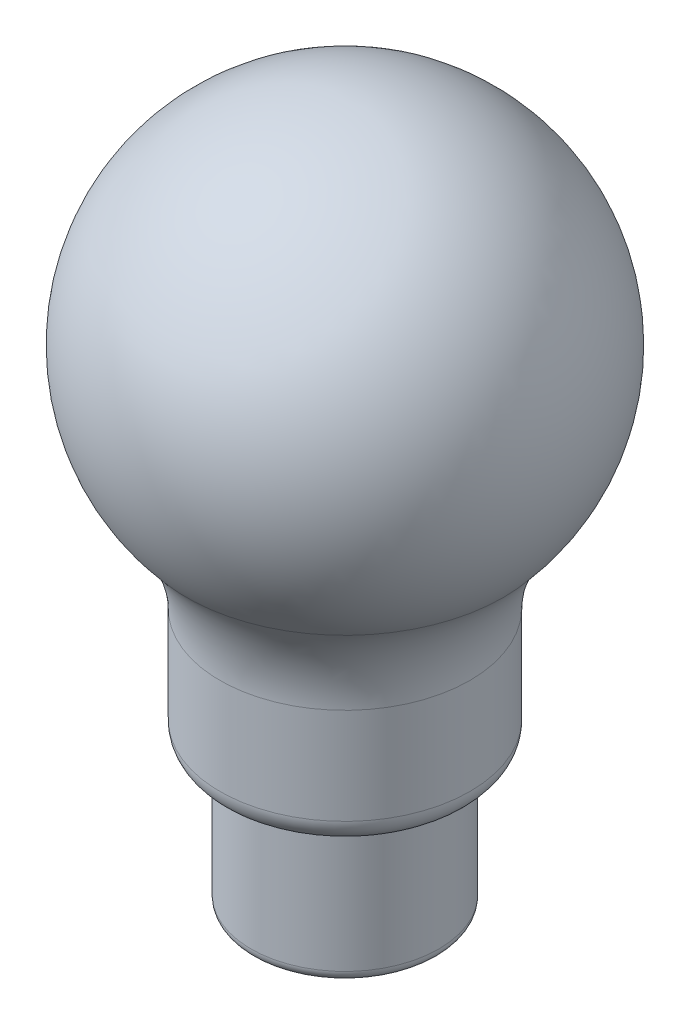
ISO-10303-21;
HEADER;
FILE_DESCRIPTION(('STEP AP214'),'2;1');
FILE_NAME('part.step','',(''),(''),'','','');
FILE_SCHEMA(('AUTOMOTIVE_DESIGN { 1 0 10303 214 1 1 1 1 }'));
ENDSEC;
DATA;
#1=APPLICATION_CONTEXT('core data for automotive mechanical design processes');
#2=APPLICATION_PROTOCOL_DEFINITION('international standard','automotive_design',2000,#1);
#3=PRODUCT_CONTEXT('',#1,'mechanical');
#4=PRODUCT('Part','Part','',(#3));
#5=PRODUCT_RELATED_PRODUCT_CATEGORY('part','',(#4));
#6=PRODUCT_DEFINITION_FORMATION('','',#4);
#7=PRODUCT_DEFINITION_CONTEXT('part definition',#1,'design');
#8=PRODUCT_DEFINITION('design','',#6,#7);
#9=PRODUCT_DEFINITION_SHAPE('','',#8);
#10=(LENGTH_UNIT() NAMED_UNIT(*) SI_UNIT(.MILLI.,.METRE.));
#11=(NAMED_UNIT(*) PLANE_ANGLE_UNIT() SI_UNIT($,.RADIAN.));
#12=(NAMED_UNIT(*) SI_UNIT($,.STERADIAN.) SOLID_ANGLE_UNIT());
#13=UNCERTAINTY_MEASURE_WITH_UNIT(LENGTH_MEASURE(1.E-05),#10,'distance_accuracy_value','');
#14=(GEOMETRIC_REPRESENTATION_CONTEXT(3) GLOBAL_UNCERTAINTY_ASSIGNED_CONTEXT((#13)) GLOBAL_UNIT_ASSIGNED_CONTEXT((#10,
#11,#12)) REPRESENTATION_CONTEXT('',''));
#15=CARTESIAN_POINT('',(0.,0.,0.));
#16=DIRECTION('',(0.,0.,1.));
#17=DIRECTION('',(1.,0.,0.));
#18=AXIS2_PLACEMENT_3D('',#15,#16,#17);
#19=CARTESIAN_POINT('',(0.,60.,0.));
#20=DIRECTION('',(0.,-1.,0.));
#21=DIRECTION('',(1.,0.,0.));
#22=AXIS2_PLACEMENT_3D('',#19,#20,#21);
#23=SPHERICAL_SURFACE('',#22,30.6);
#24=CARTESIAN_POINT('',(0.,39.7600024703559,0.));
#25=DIRECTION('',(0.,-1.,0.));
#26=DIRECTION('',(1.,0.,0.));
#27=AXIS2_PLACEMENT_3D('',#24,#25,#26);
#28=CIRCLE('',#27,22.95);
#29=CARTESIAN_POINT('',(22.95,39.7600024703559,0.));
#30=VERTEX_POINT('',#29);
#31=EDGE_CURVE('E11',#30,#30,#28,.T.);
#32=ORIENTED_EDGE('',*,*,#31,.F.);
#33=EDGE_LOOP('',(#32));
#34=FACE_BOUND('',#33,.T.);
#35=ADVANCED_FACE('F42',(#34),#23,.T.);
#36=CARTESIAN_POINT('',(0.,26.9281086116926,0.));
#37=DIRECTION('',(0.,-1.,0.));
#38=DIRECTION('',(1.,0.,0.));
#39=AXIS2_PLACEMENT_3D('',#36,#37,#38);
#40=TOROIDAL_SURFACE('',#39,37.5,19.4);
#41=CARTESIAN_POINT('',(0.,26.9281086116926,0.));
#42=DIRECTION('',(0.,-1.,0.));
#43=DIRECTION('',(1.,0.,0.));
#44=AXIS2_PLACEMENT_3D('',#41,#42,#43);
#45=CIRCLE('',#44,18.1);
#46=CARTESIAN_POINT('',(18.1,26.9281086116926,0.));
#47=VERTEX_POINT('',#46);
#48=EDGE_CURVE('E48',#47,#47,#45,.T.);
#49=ORIENTED_EDGE('',*,*,#48,.F.);
#50=EDGE_LOOP('',(#49));
#51=FACE_BOUND('',#50,.T.);
#52=ORIENTED_EDGE('',*,*,#31,.T.);
#53=EDGE_LOOP('',(#52));
#54=FACE_BOUND('',#53,.T.);
#55=ADVANCED_FACE('F180',(#51,#54),#40,.F.);
#56=CARTESIAN_POINT('',(0.,-10.6,0.));
#57=DIRECTION('',(0.,-1.,0.));
#58=DIRECTION('',(1.,0.,0.));
#59=AXIS2_PLACEMENT_3D('',#56,#57,#58);
#60=CYLINDRICAL_SURFACE('',#59,18.1);
#61=CARTESIAN_POINT('',(0.,13.,0.));
#62=DIRECTION('',(0.,-1.,0.));
#63=DIRECTION('',(1.,0.,0.));
#64=AXIS2_PLACEMENT_3D('',#61,#62,#63);
#65=CIRCLE('',#64,18.1);
#66=CARTESIAN_POINT('',(18.1,13.,0.));
#67=VERTEX_POINT('',#66);
#68=EDGE_CURVE('E52',#67,#67,#65,.T.);
#69=ORIENTED_EDGE('',*,*,#68,.F.);
#70=EDGE_LOOP('',(#69));
#71=FACE_BOUND('',#70,.T.);
#72=ORIENTED_EDGE('',*,*,#48,.T.);
#73=EDGE_LOOP('',(#72));
#74=FACE_BOUND('',#73,.T.);
#75=ADVANCED_FACE('F175',(#71,#74),#60,.T.);
#76=CARTESIAN_POINT('',(0.,13.,0.));
#77=DIRECTION('',(0.,-1.,0.));
#78=DIRECTION('',(1.,0.,0.));
#79=AXIS2_PLACEMENT_3D('',#76,#77,#78);
#80=TOROIDAL_SURFACE('',#79,14.5,3.6);
#81=CARTESIAN_POINT('',(0.,9.4,0.));
#82=DIRECTION('',(0.,-1.,0.));
#83=DIRECTION('',(1.,0.,0.));
#84=AXIS2_PLACEMENT_3D('',#81,#82,#83);
#85=CIRCLE('',#84,14.5);
#86=CARTESIAN_POINT('',(14.5,9.4,0.));
#87=VERTEX_POINT('',#86);
#88=EDGE_CURVE('E56',#87,#87,#85,.T.);
#89=ORIENTED_EDGE('',*,*,#88,.F.);
#90=EDGE_LOOP('',(#89));
#91=FACE_BOUND('',#90,.T.);
#92=ORIENTED_EDGE('',*,*,#68,.T.);
#93=EDGE_LOOP('',(#92));
#94=FACE_BOUND('',#93,.T.);
#95=ADVANCED_FACE('F169',(#91,#94),#80,.T.);
#96=CARTESIAN_POINT('',(-14.5,9.4,0.));
#97=DIRECTION('',(0.,1.,0.));
#98=DIRECTION('',(-1.,0.,0.));
#99=AXIS2_PLACEMENT_3D('',#96,#97,#98);
#100=PLANE('',#99);
#101=CARTESIAN_POINT('',(0.,9.4,0.));
#102=DIRECTION('',(0.,-1.,0.));
#103=DIRECTION('',(1.,0.,0.));
#104=AXIS2_PLACEMENT_3D('',#101,#102,#103);
#105=CIRCLE('',#104,14.);
#106=CARTESIAN_POINT('',(14.,9.4,0.));
#107=VERTEX_POINT('',#106);
#108=EDGE_CURVE('E61',#107,#107,#105,.T.);
#109=ORIENTED_EDGE('',*,*,#108,.F.);
#110=EDGE_LOOP('',(#109));
#111=FACE_BOUND('',#110,.T.);
#112=ORIENTED_EDGE('',*,*,#88,.T.);
#113=EDGE_LOOP('',(#112));
#114=FACE_BOUND('',#113,.T.);
#115=ADVANCED_FACE('F163',(#111,#114),#100,.F.);
#116=CARTESIAN_POINT('',(0.,8.99999999999999,0.));
#117=DIRECTION('',(0.,-1.,0.));
#118=DIRECTION('',(1.,0.,0.));
#119=AXIS2_PLACEMENT_3D('',#116,#117,#118);
#120=TOROIDAL_SURFACE('',#119,14.,0.400000000000001);
#121=CARTESIAN_POINT('',(0.,8.99999999999999,0.));
#122=DIRECTION('',(0.,-1.,0.));
#123=DIRECTION('',(1.,0.,0.));
#124=AXIS2_PLACEMENT_3D('',#121,#122,#123);
#125=CIRCLE('',#124,13.6);
#126=CARTESIAN_POINT('',(13.6,8.99999999999999,0.));
#127=VERTEX_POINT('',#126);
#128=EDGE_CURVE('E64',#127,#127,#125,.T.);
#129=ORIENTED_EDGE('',*,*,#128,.F.);
#130=EDGE_LOOP('',(#129));
#131=FACE_BOUND('',#130,.T.);
#132=ORIENTED_EDGE('',*,*,#108,.T.);
#133=EDGE_LOOP('',(#132));
#134=FACE_BOUND('',#133,.T.);
#135=ADVANCED_FACE('F157',(#131,#134),#120,.F.);
#136=CARTESIAN_POINT('',(0.,-10.6,0.));
#137=DIRECTION('',(0.,-1.,0.));
#138=DIRECTION('',(1.,0.,0.));
#139=AXIS2_PLACEMENT_3D('',#136,#137,#138);
#140=CYLINDRICAL_SURFACE('',#139,13.6);
#141=CARTESIAN_POINT('',(0.,-9.00000000000001,0.));
#142=DIRECTION('',(0.,-1.,0.));
#143=DIRECTION('',(1.,0.,0.));
#144=AXIS2_PLACEMENT_3D('',#141,#142,#143);
#145=CIRCLE('',#144,13.6);
#146=CARTESIAN_POINT('',(13.6,-9.00000000000001,0.));
#147=VERTEX_POINT('',#146);
#148=EDGE_CURVE('E67',#147,#147,#145,.T.);
#149=ORIENTED_EDGE('',*,*,#148,.F.);
#150=EDGE_LOOP('',(#149));
#151=FACE_BOUND('',#150,.T.);
#152=ORIENTED_EDGE('',*,*,#128,.T.);
#153=EDGE_LOOP('',(#152));
#154=FACE_BOUND('',#153,.T.);
#155=ADVANCED_FACE('F151',(#151,#154),#140,.T.);
#156=CARTESIAN_POINT('',(0.,-9.00000000000001,0.));
#157=DIRECTION('',(0.,-1.,0.));
#158=DIRECTION('',(1.,0.,0.));
#159=AXIS2_PLACEMENT_3D('',#156,#157,#158);
#160=TOROIDAL_SURFACE('',#159,12.,1.6);
#161=CARTESIAN_POINT('',(0.,-10.6,0.));
#162=DIRECTION('',(0.,-1.,0.));
#163=DIRECTION('',(1.,0.,0.));
#164=AXIS2_PLACEMENT_3D('',#161,#162,#163);
#165=CIRCLE('',#164,12.);
#166=CARTESIAN_POINT('',(12.,-10.6,0.));
#167=VERTEX_POINT('',#166);
#168=EDGE_CURVE('E70',#167,#167,#165,.T.);
#169=ORIENTED_EDGE('',*,*,#168,.F.);
#170=EDGE_LOOP('',(#169));
#171=FACE_BOUND('',#170,.T.);
#172=ORIENTED_EDGE('',*,*,#148,.T.);
#173=EDGE_LOOP('',(#172));
#174=FACE_BOUND('',#173,.T.);
#175=ADVANCED_FACE('F145',(#171,#174),#160,.T.);
#176=CARTESIAN_POINT('',(0.,-10.6,0.));
#177=DIRECTION('',(0.,-1.,0.));
#178=DIRECTION('',(1.,0.,0.));
#179=AXIS2_PLACEMENT_3D('',#176,#177,#178);
#180=CYLINDRICAL_SURFACE('',#179,12.);
#181=CARTESIAN_POINT('',(0.,-10.,0.));
#182=DIRECTION('',(0.,-1.,0.));
#183=DIRECTION('',(1.,0.,0.));
#184=AXIS2_PLACEMENT_3D('',#181,#182,#183);
#185=CIRCLE('',#184,12.);
#186=CARTESIAN_POINT('',(12.,-10.,0.));
#187=VERTEX_POINT('',#186);
#188=EDGE_CURVE('E73',#187,#187,#185,.T.);
#189=ORIENTED_EDGE('',*,*,#188,.F.);
#190=EDGE_LOOP('',(#189));
#191=FACE_BOUND('',#190,.T.);
#192=ORIENTED_EDGE('',*,*,#168,.T.);
#193=EDGE_LOOP('',(#192));
#194=FACE_BOUND('',#193,.T.);
#195=ADVANCED_FACE('F139',(#191,#194),#180,.F.);
#196=CARTESIAN_POINT('',(0.,-9.00000000000001,0.));
#197=DIRECTION('',(0.,-1.,0.));
#198=DIRECTION('',(1.,0.,0.));
#199=AXIS2_PLACEMENT_3D('',#196,#197,#198);
#200=TOROIDAL_SURFACE('',#199,12.,1.);
#201=CARTESIAN_POINT('',(0.,-9.,0.));
#202=DIRECTION('',(0.,-1.,0.));
#203=DIRECTION('',(1.,0.,0.));
#204=AXIS2_PLACEMENT_3D('',#201,#202,#203);
#205=CIRCLE('',#204,13.);
#206=CARTESIAN_POINT('',(13.,-9.,0.));
#207=VERTEX_POINT('',#206);
#208=EDGE_CURVE('E76',#207,#207,#205,.T.);
#209=ORIENTED_EDGE('',*,*,#208,.F.);
#210=EDGE_LOOP('',(#209));
#211=FACE_BOUND('',#210,.T.);
#212=ORIENTED_EDGE('',*,*,#188,.T.);
#213=EDGE_LOOP('',(#212));
#214=FACE_BOUND('',#213,.T.);
#215=ADVANCED_FACE('F133',(#211,#214),#200,.F.);
#216=CARTESIAN_POINT('',(0.,-10.6,0.));
#217=DIRECTION('',(0.,-1.,0.));
#218=DIRECTION('',(1.,0.,0.));
#219=AXIS2_PLACEMENT_3D('',#216,#217,#218);
#220=CYLINDRICAL_SURFACE('',#219,13.);
#221=CARTESIAN_POINT('',(0.,8.99999999999999,0.));
#222=DIRECTION('',(0.,-1.,0.));
#223=DIRECTION('',(1.,0.,0.));
#224=AXIS2_PLACEMENT_3D('',#221,#222,#223);
#225=CIRCLE('',#224,13.);
#226=CARTESIAN_POINT('',(13.,8.99999999999999,0.));
#227=VERTEX_POINT('',#226);
#228=EDGE_CURVE('E79',#227,#227,#225,.T.);
#229=ORIENTED_EDGE('',*,*,#228,.F.);
#230=EDGE_LOOP('',(#229));
#231=FACE_BOUND('',#230,.T.);
#232=ORIENTED_EDGE('',*,*,#208,.T.);
#233=EDGE_LOOP('',(#232));
#234=FACE_BOUND('',#233,.T.);
#235=ADVANCED_FACE('F127',(#231,#234),#220,.F.);
#236=CARTESIAN_POINT('',(0.,8.99999999999999,0.));
#237=DIRECTION('',(0.,-1.,0.));
#238=DIRECTION('',(1.,0.,0.));
#239=AXIS2_PLACEMENT_3D('',#236,#237,#238);
#240=TOROIDAL_SURFACE('',#239,14.,1.);
#241=CARTESIAN_POINT('',(0.,9.99999999999999,0.));
#242=DIRECTION('',(0.,-1.,0.));
#243=DIRECTION('',(1.,0.,0.));
#244=AXIS2_PLACEMENT_3D('',#241,#242,#243);
#245=CIRCLE('',#244,14.);
#246=CARTESIAN_POINT('',(14.,9.99999999999999,0.));
#247=VERTEX_POINT('',#246);
#248=EDGE_CURVE('E82',#247,#247,#245,.T.);
#249=ORIENTED_EDGE('',*,*,#248,.F.);
#250=EDGE_LOOP('',(#249));
#251=FACE_BOUND('',#250,.T.);
#252=ORIENTED_EDGE('',*,*,#228,.T.);
#253=EDGE_LOOP('',(#252));
#254=FACE_BOUND('',#253,.T.);
#255=ADVANCED_FACE('F121',(#251,#254),#240,.T.);
#256=CARTESIAN_POINT('',(-14.5,9.99999999999999,0.));
#257=DIRECTION('',(0.,-1.,0.));
#258=DIRECTION('',(1.,0.,0.));
#259=AXIS2_PLACEMENT_3D('',#256,#257,#258);
#260=PLANE('',#259);
#261=CARTESIAN_POINT('',(0.,9.99999999999999,0.));
#262=DIRECTION('',(0.,-1.,0.));
#263=DIRECTION('',(1.,0.,0.));
#264=AXIS2_PLACEMENT_3D('',#261,#262,#263);
#265=CIRCLE('',#264,14.5);
#266=CARTESIAN_POINT('',(14.5,9.99999999999999,0.));
#267=VERTEX_POINT('',#266);
#268=EDGE_CURVE('E85',#267,#267,#265,.T.);
#269=ORIENTED_EDGE('',*,*,#268,.F.);
#270=EDGE_LOOP('',(#269));
#271=FACE_BOUND('',#270,.T.);
#272=ORIENTED_EDGE('',*,*,#248,.T.);
#273=EDGE_LOOP('',(#272));
#274=FACE_BOUND('',#273,.T.);
#275=ADVANCED_FACE('F115',(#271,#274),#260,.F.);
#276=CARTESIAN_POINT('',(0.,13.,0.));
#277=DIRECTION('',(0.,-1.,0.));
#278=DIRECTION('',(1.,0.,0.));
#279=AXIS2_PLACEMENT_3D('',#276,#277,#278);
#280=TOROIDAL_SURFACE('',#279,14.5,3.);
#281=CARTESIAN_POINT('',(0.,13.,0.));
#282=DIRECTION('',(0.,-1.,0.));
#283=DIRECTION('',(1.,0.,0.));
#284=AXIS2_PLACEMENT_3D('',#281,#282,#283);
#285=CIRCLE('',#284,17.5);
#286=CARTESIAN_POINT('',(17.5,13.,0.));
#287=VERTEX_POINT('',#286);
#288=EDGE_CURVE('E88',#287,#287,#285,.T.);
#289=ORIENTED_EDGE('',*,*,#288,.F.);
#290=EDGE_LOOP('',(#289));
#291=FACE_BOUND('',#290,.T.);
#292=ORIENTED_EDGE('',*,*,#268,.T.);
#293=EDGE_LOOP('',(#292));
#294=FACE_BOUND('',#293,.T.);
#295=ADVANCED_FACE('F109',(#291,#294),#280,.F.);
#296=CARTESIAN_POINT('',(0.,-10.6,0.));
#297=DIRECTION('',(0.,-1.,0.));
#298=DIRECTION('',(1.,0.,0.));
#299=AXIS2_PLACEMENT_3D('',#296,#297,#298);
#300=CYLINDRICAL_SURFACE('',#299,17.5);
#301=CARTESIAN_POINT('',(0.,26.9281086116926,0.));
#302=DIRECTION('',(0.,-1.,0.));
#303=DIRECTION('',(1.,0.,0.));
#304=AXIS2_PLACEMENT_3D('',#301,#302,#303);
#305=CIRCLE('',#304,17.5);
#306=CARTESIAN_POINT('',(17.5,26.9281086116926,0.));
#307=VERTEX_POINT('',#306);
#308=EDGE_CURVE('E91',#307,#307,#305,.T.);
#309=ORIENTED_EDGE('',*,*,#308,.F.);
#310=EDGE_LOOP('',(#309));
#311=FACE_BOUND('',#310,.T.);
#312=ORIENTED_EDGE('',*,*,#288,.T.);
#313=EDGE_LOOP('',(#312));
#314=FACE_BOUND('',#313,.T.);
#315=ADVANCED_FACE('F103',(#311,#314),#300,.F.);
#316=CARTESIAN_POINT('',(0.,26.9281086116926,0.));
#317=DIRECTION('',(0.,-1.,0.));
#318=DIRECTION('',(1.,0.,0.));
#319=AXIS2_PLACEMENT_3D('',#316,#317,#318);
#320=TOROIDAL_SURFACE('',#319,37.5,20.);
#321=CARTESIAN_POINT('',(0.,40.1568651670156,0.));
#322=DIRECTION('',(0.,-1.,0.));
#323=DIRECTION('',(1.,0.,0.));
#324=AXIS2_PLACEMENT_3D('',#321,#322,#323);
#325=CIRCLE('',#324,22.5);
#326=CARTESIAN_POINT('',(22.5,40.1568651670156,0.));
#327=VERTEX_POINT('',#326);
#328=EDGE_CURVE('E94',#327,#327,#325,.T.);
#329=ORIENTED_EDGE('',*,*,#328,.F.);
#330=EDGE_LOOP('',(#329));
#331=FACE_BOUND('',#330,.T.);
#332=ORIENTED_EDGE('',*,*,#308,.T.);
#333=EDGE_LOOP('',(#332));
#334=FACE_BOUND('',#333,.T.);
#335=ADVANCED_FACE('F100',(#331,#334),#320,.T.);
#336=CARTESIAN_POINT('',(0.,60.,0.));
#337=DIRECTION('',(0.,-1.,0.));
#338=DIRECTION('',(-1.,0.,0.));
#339=AXIS2_PLACEMENT_3D('',#336,#337,#338);
#340=SPHERICAL_SURFACE('',#339,30.);
#341=ORIENTED_EDGE('',*,*,#328,.T.);
#342=EDGE_LOOP('',(#341));
#343=FACE_BOUND('',#342,.T.);
#344=ADVANCED_FACE('F98',(#343),#340,.F.);
#345=CLOSED_SHELL('',(#35,#55,#75,#95,#115,#135,#155,#175,#195,#215,#235,#255,#275,#295,#315,
#335,#344));
#346=MANIFOLD_SOLID_BREP('B2',#345);
#347=CARTESIAN_POINT('',(-7.5,0.,0.));
#348=DIRECTION('',(0.,1.,0.));
#349=DIRECTION('',(0.,0.,1.));
#350=AXIS2_PLACEMENT_3D('',#347,#348,#349);
#351=PLANE('',#350);
#352=CARTESIAN_POINT('',(-7.5,0.,0.));
#353=DIRECTION('',(0.,1.,0.));
#354=DIRECTION('',(0.,0.,1.));
#355=AXIS2_PLACEMENT_3D('',#352,#353,#354);
#356=CIRCLE('',#355,0.500000000000001);
#357=CARTESIAN_POINT('',(-7.5,0.,0.500000000000001));
#358=VERTEX_POINT('',#357);
#359=EDGE_CURVE('E313',#358,#358,#356,.T.);
#360=ORIENTED_EDGE('',*,*,#359,.F.);
#361=EDGE_LOOP('',(#360));
#362=FACE_BOUND('',#361,.T.);
#363=ADVANCED_FACE('F301',(#362),#351,.F.);
#364=CARTESIAN_POINT('',(-8.,50.,0.));
#365=DIRECTION('',(-0.033321671547809,0.999444678911874,0.));
#366=DIRECTION('',(0.,0.,1.));
#367=AXIS2_PLACEMENT_3D('',#364,#365,#366);
#368=PLANE('',#367);
#369=CARTESIAN_POINT('',(-8.,50.,0.));
#370=DIRECTION('',(-0.033321671547809,0.999444678911874,0.));
#371=DIRECTION('',(0.,0.,1.));
#372=AXIS2_PLACEMENT_3D('',#369,#370,#371);
#373=CIRCLE('',#372,0.500000000000001);
#374=CARTESIAN_POINT('',(-8.,50.,0.500000000000001));
#375=VERTEX_POINT('',#374);
#376=EDGE_CURVE('E40',#375,#375,#373,.T.);
#377=ORIENTED_EDGE('',*,*,#376,.T.);
#378=EDGE_LOOP('',(#377));
#379=FACE_BOUND('',#378,.T.);
#380=ADVANCED_FACE('F321',(#379),#368,.T.);
#381=CARTESIAN_POINT('',(-7.5,0.,0.500000000000001));
#382=CARTESIAN_POINT('',(-7.38890431773929,16.6689811921876,0.500000000000001));
#383=CARTESIAN_POINT('',(-7.55557098441971,33.3356478588716,0.500000000000001));
#384=CARTESIAN_POINT('',(-8.,50.,0.500000000000001));
#385=CARTESIAN_POINT('',(-6.5,0.,0.500000000000001));
#386=CARTESIAN_POINT('',(-6.38890431773567,16.6800890330693,0.500000000000001));
#387=CARTESIAN_POINT('',(-6.55575621482854,33.3578690913781,0.500000000000001));
#388=CARTESIAN_POINT('',(-7.00055532108813,50.0333216715478,0.500000000000001));
#389=CARTESIAN_POINT('',(-6.5,0.,-0.500000000000001));
#390=CARTESIAN_POINT('',(-6.38890431773567,16.6800890330693,-0.500000000000001));
#391=CARTESIAN_POINT('',(-6.55575621482854,33.3578690913781,-0.500000000000001));
#392=CARTESIAN_POINT('',(-7.00055532108813,50.0333216715478,-0.500000000000001));
#393=CARTESIAN_POINT('',(-7.5,0.,-0.500000000000001));
#394=CARTESIAN_POINT('',(-7.38890431773929,16.6689811921876,-0.500000000000001));
#395=CARTESIAN_POINT('',(-7.55557098441971,33.3356478588716,-0.500000000000001));
#396=CARTESIAN_POINT('',(-8.,50.,-0.500000000000001));
#397=CARTESIAN_POINT('',(-8.5,0.,-0.500000000000001));
#398=CARTESIAN_POINT('',(-8.3889043177429,16.6578733513058,-0.500000000000001));
#399=CARTESIAN_POINT('',(-8.55538575401087,33.3134266263651,-0.500000000000001));
#400=CARTESIAN_POINT('',(-8.99944467891188,49.9666783284522,-0.500000000000001));
#401=CARTESIAN_POINT('',(-8.5,0.,0.500000000000001));
#402=CARTESIAN_POINT('',(-8.3889043177429,16.6578733513058,0.500000000000001));
#403=CARTESIAN_POINT('',(-8.55538575401087,33.3134266263651,0.500000000000001));
#404=CARTESIAN_POINT('',(-8.99944467891188,49.9666783284522,0.500000000000001));
#405=CARTESIAN_POINT('',(-7.5,0.,0.500000000000001));
#406=CARTESIAN_POINT('',(-7.38890431773929,16.6689811921876,0.500000000000001));
#407=CARTESIAN_POINT('',(-7.55557098441971,33.3356478588716,0.500000000000001));
#408=CARTESIAN_POINT('',(-8.,50.,0.500000000000001));
#409=(BOUNDED_SURFACE() B_SPLINE_SURFACE(3,3,((#381,#382,#383,#384),(#385,#386,#387,#388),(#389,
#390,#391,#392),(#393,#394,#395,#396),(#397,#398,#399,#400),(#401,#402,#403,#404),(#405,#406,
#407,#408)),.UNSPECIFIED.,.T.,.F.,.F.) B_SPLINE_SURFACE_WITH_KNOTS((4,3,4),(4,4),(0.,0.5,1.),
(0.,1.),.UNSPECIFIED.) GEOMETRIC_REPRESENTATION_ITEM() RATIONAL_B_SPLINE_SURFACE(((1.,1.,1.,1.),
(0.333333333333333,0.333333333333333,0.333333333333333,0.333333333333333),(0.333333333333333,
0.333333333333333,0.333333333333333,0.333333333333333),(1.,1.,1.,1.),(0.333333333333333,
0.333333333333333,0.333333333333333,0.333333333333333),(0.333333333333333,0.333333333333333,
0.333333333333333,0.333333333333333),(1.,1.,1.,1.))) REPRESENTATION_ITEM('') SURFACE());
#410=CARTESIAN_POINT('',(-7.51483681204918,49.,-0.19902371186404));
#411=CARTESIAN_POINT('',(-7.51517709232452,49.0132447334164,-0.199017755515471));
#412=CARTESIAN_POINT('',(-7.51457763798246,49.0265328271919,-0.196878854861582));
#413=CARTESIAN_POINT('',(-7.5117970515096,49.0515680290947,-0.188655941320381));
#414=CARTESIAN_POINT('',(-7.50961836237461,49.0633174843108,-0.182578023428362));
#415=CARTESIAN_POINT('',(-7.50433544868718,49.0847030924109,-0.166939550761019));
#416=CARTESIAN_POINT('',(-7.50119657002605,49.094231321699,-0.157244947701196));
#417=CARTESIAN_POINT('',(-7.49470366052559,49.110233679619,-0.134659147005632));
#418=CARTESIAN_POINT('',(-7.49134841479063,49.11648040691,-0.121606359225872));
#419=CARTESIAN_POINT('',(-7.48543573507246,49.1242466149204,-0.0938984437468798));
#420=CARTESIAN_POINT('',(-7.48288235093723,49.1257424362879,-0.0792356715633702));
#421=CARTESIAN_POINT('',(-7.47909638388248,49.1235982112357,-0.0506583042013944));
#422=CARTESIAN_POINT('',(-7.47781868997836,49.1201449766677,-0.0367360223425042));
#423=CARTESIAN_POINT('',(-7.47630297900317,49.1089053022549,-0.011131158339641));
#424=CARTESIAN_POINT('',(-7.47603972911151,49.1012295330343,0.000598777270067193));
#425=CARTESIAN_POINT('',(-7.47598496986063,49.0824342369158,0.0209640152088744));
#426=CARTESIAN_POINT('',(-7.47619573313149,49.0712983411253,0.0295841780934244));
#427=CARTESIAN_POINT('',(-7.47650818643177,49.0466801955521,0.0427795714563394));
#428=CARTESIAN_POINT('',(-7.47660865686307,49.0331735888759,0.0473094772741834));
#429=CARTESIAN_POINT('',(-7.47631709983292,49.0054409231619,0.0516429366297732));
#430=CARTESIAN_POINT('',(-7.47592559751163,48.991215646791,0.0514515257219447));
#431=CARTESIAN_POINT('',(-7.47471488979079,48.9636766113153,0.0463979632199125));
#432=CARTESIAN_POINT('',(-7.47389658655974,48.9503609962637,0.0415456456752786));
#433=CARTESIAN_POINT('',(-7.47230453823803,48.925990496523,0.0276879785302688));
#434=CARTESIAN_POINT('',(-7.47153108434455,48.914949405588,0.0186583086230816));
#435=CARTESIAN_POINT('',(-7.47071561670913,48.8964928469214,-0.00255342706084687));
#436=CARTESIAN_POINT('',(-7.4706716594419,48.8890677966417,-0.0147270287576783));
#437=CARTESIAN_POINT('',(-7.47184402601425,48.8787870000576,-0.0405373687042223));
#438=CARTESIAN_POINT('',(-7.47303510458604,48.8758426434352,-0.0541398860812502));
#439=CARTESIAN_POINT('',(-7.47670767196463,48.8744781092943,-0.0812473403029313));
#440=CARTESIAN_POINT('',(-7.47917696047299,48.8760157831259,-0.0947519966690528));
#441=CARTESIAN_POINT('',(-7.4850980732061,48.8832641154714,-0.120778868319435));
#442=CARTESIAN_POINT('',(-7.48857684501629,48.8890970838516,-0.133260111387992));
#443=CARTESIAN_POINT('',(-7.49592457328012,48.9047783965278,-0.15625546637269));
#444=CARTESIAN_POINT('',(-7.49980439071636,48.9148173338421,-0.166635860658294));
#445=CARTESIAN_POINT('',(-7.50676711555614,48.9382104699953,-0.183646972471138));
#446=CARTESIAN_POINT('',(-7.50983771124693,48.9516104324357,-0.190221400985941));
#447=CARTESIAN_POINT('',(-7.51352495050318,48.9768903007421,-0.197406080849437));
#448=CARTESIAN_POINT('',(-7.51453952268287,48.9884286022734,-0.199028915689299));
#449=CARTESIAN_POINT('',(-7.51483681204918,49.,-0.19902371186404));
#450=B_SPLINE_CURVE_WITH_KNOTS('',3,(#410,#411,#412,#413,#414,#415,#416,#417,#418,#419,#420,
#421,#422,#423,#424,#425,#426,#427,#428,#429,#430,#431,#432,#433,#434,#435,#436,#437,#438,#439,
#440,#441,#442,#443,#444,#445,#446,#447,#448,#449),.UNSPECIFIED.,.T.,.F.,(4,2,2,2,2,2,2,2,2,2,2,
2,2,2,2,2,2,2,2,4),(0.,0.039592886696796,0.0791246555725274,0.120296814297563,0.164035445275256,
0.207991554389877,0.250331498889567,0.291611232571643,0.333089301352971,0.375021545891763,
0.416909069228267,0.458708407740906,0.500754222810353,0.542688001361101,0.583781197491284,
0.624489206955193,0.666403537459413,0.710467518654141,0.755167557690553,0.789758290829908),.UNSPECIFIED.);
#451=CARTESIAN_POINT('',(-7.51483681204918,49.,-0.19902371186404));
#452=VERTEX_POINT('',#451);
#453=EDGE_CURVE('E304',#452,#452,#450,.T.);
#454=CARTESIAN_POINT('',(-8.43249134671824,49.,-0.19902371186404));
#455=CARTESIAN_POINT('',(-8.43215086450117,48.9867557906451,-0.199017763944987));
#456=CARTESIAN_POINT('',(-8.43275041697833,48.9734682320109,-0.196879022944049));
#457=CARTESIAN_POINT('',(-8.4355316492986,48.9484340393492,-0.188656801780419));
#458=CARTESIAN_POINT('',(-8.43771088384092,48.9366850568005,-0.182579420054941));
#459=CARTESIAN_POINT('',(-8.442995166711,48.915299867537,-0.166942196644388));
#460=CARTESIAN_POINT('',(-8.44613489913498,48.9057716420828,-0.157248235633921));
#461=CARTESIAN_POINT('',(-8.45262962029449,48.8897685853902,-0.134663293637853));
#462=CARTESIAN_POINT('',(-8.45598581941849,48.8835212962277,-0.121610606888535));
#463=CARTESIAN_POINT('',(-8.46189983286696,48.875754029488,-0.0939025728522623));
#464=CARTESIAN_POINT('',(-8.46445359812138,48.8742576905777,-0.0792395859494822));
#465=CARTESIAN_POINT('',(-8.46823943503339,48.8764010988676,-0.0506621076870679));
#466=CARTESIAN_POINT('',(-8.46951669222145,48.8798538395993,-0.0367399305336801));
#467=CARTESIAN_POINT('',(-8.47103104230211,48.8910923696875,-0.0111352792979944));
#468=CARTESIAN_POINT('',(-8.4712933942727,48.8987674290564,0.000594570166586746));
#469=CARTESIAN_POINT('',(-8.47134630393393,48.9175613728645,0.0209601784785145));
#470=CARTESIAN_POINT('',(-8.47113457931048,48.9286966936512,0.0295807366197942));
#471=CARTESIAN_POINT('',(-8.47082059084127,48.9533140341711,0.0427772663725964));
#472=CARTESIAN_POINT('',(-8.47071955273544,48.9668204475037,0.0473078509036341));
#473=CARTESIAN_POINT('',(-8.47101074294485,48.9945528310176,0.0516426539492953));
#474=CARTESIAN_POINT('',(-8.47140244057624,49.0087780112482,0.0514519532298795));
#475=CARTESIAN_POINT('',(-8.47261431414744,49.0363169397228,0.0463998817599961));
#476=CARTESIAN_POINT('',(-8.4734335829246,49.0496325503878,0.041548381411949));
#477=CARTESIAN_POINT('',(-8.47502806610878,49.074003555458,0.0276922996897537));
#478=CARTESIAN_POINT('',(-8.47580299137984,49.0850451197371,0.0186633309323136));
#479=CARTESIAN_POINT('',(-8.476621354364,49.1035030075084,-0.00254739954099989));
#480=CARTESIAN_POINT('',(-8.47666672706435,49.1109288700932,-0.0147207342057029));
#481=CARTESIAN_POINT('',(-8.47549651524491,49.121211108202,-0.0405305899377833));
#482=CARTESIAN_POINT('',(-8.47430622219535,49.1241562100792,-0.0541328377553698));
#483=CARTESIAN_POINT('',(-8.47063445145195,49.1255222781045,-0.0812394237463705));
#484=CARTESIAN_POINT('',(-8.46816522922529,49.1239855556598,-0.0947434787937508));
#485=CARTESIAN_POINT('',(-8.46224356631855,49.116739571105,-0.120769458251198));
#486=CARTESIAN_POINT('',(-8.45876415268985,49.1109079867385,-0.13325040936719));
#487=CARTESIAN_POINT('',(-8.45141439403007,49.0952294753485,-0.156246312529642));
#488=CARTESIAN_POINT('',(-8.44753314961529,49.0851917726497,-0.16662743404309));
#489=CARTESIAN_POINT('',(-8.4405671725089,49.0618002702805,-0.183640974503079));
#490=CARTESIAN_POINT('',(-8.4374947899897,49.0484005484804,-0.190216922700065));
#491=CARTESIAN_POINT('',(-8.43380453357767,49.023117241731,-0.197404992927393));
#492=CARTESIAN_POINT('',(-8.43278892143728,49.0115751768527,-0.199028910227574));
#493=CARTESIAN_POINT('',(-8.43249134671824,49.,-0.19902371186404));
#494=B_SPLINE_CURVE_WITH_KNOTS('',3,(#454,#455,#456,#457,#458,#459,#460,#461,#462,#463,#464,
#465,#466,#467,#468,#469,#470,#471,#472,#473,#474,#475,#476,#477,#478,#479,#480,#481,#482,#483,
#484,#485,#486,#487,#488,#489,#490,#491,#492,#493),.UNSPECIFIED.,.T.,.F.,(4,2,2,2,2,2,2,2,2,2,2,
2,2,2,2,2,2,2,2,4),(0.,0.0395912779819557,0.0791214003650208,0.120292872495667,
0.164032567678703,0.207989554301559,0.250328706026973,0.291607069232483,0.333084583044847,
0.375016914734625,0.41690412331016,0.458702820401288,0.50074867156515,0.542682986358578,
0.583775601683964,0.624481534827049,0.666393974243726,0.710458184164826,0.755160584464682,
0.789762577847951),.UNSPECIFIED.);
#495=CARTESIAN_POINT('',(-8.43249134671824,49.,-0.19902371186404));
#496=VERTEX_POINT('',#495);
#497=EDGE_CURVE('E330',#496,#496,#494,.T.);
#498=ORIENTED_EDGE('',*,*,#453,.F.);
#499=EDGE_LOOP('',(#498));
#500=FACE_BOUND('',#499,.T.);
#501=ORIENTED_EDGE('',*,*,#497,.F.);
#502=EDGE_LOOP('',(#501));
#503=FACE_BOUND('',#502,.T.);
#504=ORIENTED_EDGE('',*,*,#376,.F.);
#505=EDGE_LOOP('',(#504));
#506=FACE_BOUND('',#505,.T.);
#507=ORIENTED_EDGE('',*,*,#359,.T.);
#508=EDGE_LOOP('',(#507));
#509=FACE_BOUND('',#508,.T.);
#510=ADVANCED_FACE('F323',(#500,#503,#506,#509),#409,.T.);
#511=CARTESIAN_POINT('',(-8.49972233945594,49.,-0.0740237118640463));
#512=DIRECTION('',(1.,0.,0.));
#513=DIRECTION('',(0.,0.,-1.));
#514=AXIS2_PLACEMENT_3D('',#511,#512,#513);
#515=CYLINDRICAL_SURFACE('',#514,0.125);
#516=ORIENTED_EDGE('',*,*,#453,.T.);
#517=EDGE_LOOP('',(#516));
#518=FACE_BOUND('',#517,.T.);
#519=ORIENTED_EDGE('',*,*,#497,.T.);
#520=EDGE_LOOP('',(#519));
#521=FACE_BOUND('',#520,.T.);
#522=ADVANCED_FACE('F326',(#518,#521),#515,.F.);
#523=CLOSED_SHELL('',(#363,#380,#510,#522));
#524=MANIFOLD_SOLID_BREP('B6',#523);
#525=CARTESIAN_POINT('',(7.5,0.,0.));
#526=DIRECTION('',(0.,1.,0.));
#527=DIRECTION('',(0.,0.,1.));
#528=AXIS2_PLACEMENT_3D('',#525,#526,#527);
#529=PLANE('',#528);
#530=CARTESIAN_POINT('',(7.5,0.,0.));
#531=DIRECTION('',(0.,1.,0.));
#532=DIRECTION('',(0.,0.,1.));
#533=AXIS2_PLACEMENT_3D('',#530,#531,#532);
#534=CIRCLE('',#533,0.500000000000001);
#535=CARTESIAN_POINT('',(7.5,0.,0.500000000000001));
#536=VERTEX_POINT('',#535);
#537=EDGE_CURVE('E391',#536,#536,#534,.T.);
#538=ORIENTED_EDGE('',*,*,#537,.F.);
#539=EDGE_LOOP('',(#538));
#540=FACE_BOUND('',#539,.T.);
#541=ADVANCED_FACE('F379',(#540),#529,.F.);
#542=CARTESIAN_POINT('',(8.33472802113059,50.,0.));
#543=DIRECTION('',(0.0677334309208276,0.997703454106326,0.));
#544=DIRECTION('',(0.,0.,1.));
#545=AXIS2_PLACEMENT_3D('',#542,#543,#544);
#546=PLANE('',#545);
#547=CARTESIAN_POINT('',(8.33472802113059,50.,0.));
#548=DIRECTION('',(0.0677334309208276,0.997703454106326,0.));
#549=DIRECTION('',(0.,0.,1.));
#550=AXIS2_PLACEMENT_3D('',#547,#548,#549);
#551=CIRCLE('',#550,0.500000000000001);
#552=CARTESIAN_POINT('',(8.33472802113059,50.,0.500000000000001));
#553=VERTEX_POINT('',#552);
#554=EDGE_CURVE('E299',#553,#553,#551,.T.);
#555=ORIENTED_EDGE('',*,*,#554,.T.);
#556=EDGE_LOOP('',(#555));
#557=FACE_BOUND('',#556,.T.);
#558=ADVANCED_FACE('F399',(#557),#546,.T.);
#559=CARTESIAN_POINT('',(7.5,0.,0.500000000000001));
#560=CARTESIAN_POINT('',(7.21311651963402,16.6741825809656,0.500000000000001));
#561=CARTESIAN_POINT('',(7.4913591934039,33.3408492476154,0.500000000000001));
#562=CARTESIAN_POINT('',(8.33472802113059,50.,0.500000000000001));
#563=CARTESIAN_POINT('',(8.5,0.,0.500000000000001));
#564=CARTESIAN_POINT('',(8.21311651963764,16.651599579293,0.500000000000001));
#565=CARTESIAN_POINT('',(8.49059156852431,33.2956365978754,0.500000000000001));
#566=CARTESIAN_POINT('',(9.33243147523691,49.9322665690792,0.500000000000001));
#567=CARTESIAN_POINT('',(8.5,0.,-0.500000000000001));
#568=CARTESIAN_POINT('',(8.21311651963764,16.651599579293,-0.500000000000001));
#569=CARTESIAN_POINT('',(8.49059156852431,33.2956365978754,-0.500000000000001));
#570=CARTESIAN_POINT('',(9.33243147523691,49.9322665690792,-0.500000000000001));
#571=CARTESIAN_POINT('',(7.5,0.,-0.500000000000001));
#572=CARTESIAN_POINT('',(7.21311651963402,16.6741825809656,-0.500000000000001));
#573=CARTESIAN_POINT('',(7.4913591934039,33.3408492476154,-0.500000000000001));
#574=CARTESIAN_POINT('',(8.33472802113059,50.,-0.500000000000001));
#575=CARTESIAN_POINT('',(6.5,0.,-0.500000000000001));
#576=CARTESIAN_POINT('',(6.21311651963041,16.6967655826383,-0.500000000000001));
#577=CARTESIAN_POINT('',(6.49212681828349,33.3860618973555,-0.500000000000001));
#578=CARTESIAN_POINT('',(7.33702456702426,50.0677334309208,-0.500000000000001));
#579=CARTESIAN_POINT('',(6.5,0.,0.500000000000001));
#580=CARTESIAN_POINT('',(6.21311651963041,16.6967655826383,0.500000000000001));
#581=CARTESIAN_POINT('',(6.49212681828349,33.3860618973555,0.500000000000001));
#582=CARTESIAN_POINT('',(7.33702456702426,50.0677334309208,0.500000000000001));
#583=CARTESIAN_POINT('',(7.5,0.,0.500000000000001));
#584=CARTESIAN_POINT('',(7.21311651963402,16.6741825809656,0.500000000000001));
#585=CARTESIAN_POINT('',(7.4913591934039,33.3408492476154,0.500000000000001));
#586=CARTESIAN_POINT('',(8.33472802113059,50.,0.500000000000001));
#587=(BOUNDED_SURFACE() B_SPLINE_SURFACE(3,3,((#559,#560,#561,#562),(#563,#564,#565,#566),(#567,
#568,#569,#570),(#571,#572,#573,#574),(#575,#576,#577,#578),(#579,#580,#581,#582),(#583,#584,
#585,#586)),.UNSPECIFIED.,.T.,.F.,.F.) B_SPLINE_SURFACE_WITH_KNOTS((4,3,4),(4,4),(0.,0.5,1.),
(0.,1.),.UNSPECIFIED.) GEOMETRIC_REPRESENTATION_ITEM() RATIONAL_B_SPLINE_SURFACE(((1.,1.,1.,1.),
(0.333333333333333,0.333333333333333,0.333333333333333,0.333333333333333),(0.333333333333333,
0.333333333333333,0.333333333333333,0.333333333333333),(1.,1.,1.,1.),(0.333333333333333,
0.333333333333333,0.333333333333333,0.333333333333333),(0.333333333333333,0.333333333333333,
0.333333333333333,0.333333333333333),(1.,1.,1.,1.))) REPRESENTATION_ITEM('') SURFACE());
#588=CARTESIAN_POINT('',(8.7439533534485,49.,-0.19902371186404));
#589=CARTESIAN_POINT('',(8.74462518071346,49.0135192995229,-0.199016109196692));
#590=CARTESIAN_POINT('',(8.74627540827085,49.0270129932184,-0.196788513896192));
#591=CARTESIAN_POINT('',(8.75104421630925,49.0522927809974,-0.188346627640902));
#592=CARTESIAN_POINT('',(8.75415957039821,49.0640825531177,-0.182141085774866));
#593=CARTESIAN_POINT('',(8.76119735062951,49.0856574932408,-0.166102387234705));
#594=CARTESIAN_POINT('',(8.76515529935932,49.0952927302415,-0.156084927675452));
#595=CARTESIAN_POINT('',(8.7730101454863,49.1113029525615,-0.132741738603556));
#596=CARTESIAN_POINT('',(8.77689082500538,49.1174618331654,-0.119260499423866));
#597=CARTESIAN_POINT('',(8.78332647123345,49.1246835440595,-0.0909620429714702));
#598=CARTESIAN_POINT('',(8.7859058013459,49.1258433542776,-0.0761759839077839));
#599=CARTESIAN_POINT('',(8.7892927617493,49.1229945814521,-0.0477792549863933));
#600=CARTESIAN_POINT('',(8.7901951537284,49.1192841897687,-0.0341504054815531));
#601=CARTESIAN_POINT('',(8.79070277673013,49.1077510967224,-0.00923034045180546));
#602=CARTESIAN_POINT('',(8.79034457203619,49.1000497494551,0.00211683790316315));
#603=CARTESIAN_POINT('',(8.78894987234576,49.0813256320188,0.0218910255372109));
#604=CARTESIAN_POINT('',(8.78790299535521,49.0702534400559,0.0302702688505879));
#605=CARTESIAN_POINT('',(8.78574591471878,49.0457088823421,0.0431610655760602));
#606=CARTESIAN_POINT('',(8.78463479676268,49.0321856462952,0.047575780872676));
#607=CARTESIAN_POINT('',(8.78285270260454,49.0043571193973,0.0516916296714777));
#608=CARTESIAN_POINT('',(8.7821833131078,48.9900492070688,0.0513758663096127));
#609=CARTESIAN_POINT('',(8.78134569460835,48.9624385788674,0.0460203861933695));
#610=CARTESIAN_POINT('',(8.78117397250918,48.949129498636,0.0410139234757933));
#611=CARTESIAN_POINT('',(8.78094102254217,48.9249011953778,0.026882474561987));
#612=CARTESIAN_POINT('',(8.78087987995132,48.9139838224912,0.0177543165591288));
#613=CARTESIAN_POINT('',(8.78028309318058,48.8957700098652,-0.0036092759686853));
#614=CARTESIAN_POINT('',(8.77974682637462,48.8884783410077,-0.015848772731774));
#615=CARTESIAN_POINT('',(8.77773993473327,48.8784084628746,-0.0418756050388008));
#616=CARTESIAN_POINT('',(8.77627718052432,48.8755929286766,-0.0556491045200067));
#617=CARTESIAN_POINT('',(8.77236222250392,48.8745767578418,-0.0831888860685227));
#618=CARTESIAN_POINT('',(8.7699115207709,48.876369137465,-0.0969551474671815));
#619=CARTESIAN_POINT('',(8.76433892196907,48.8843079438868,-0.123374105871411));
#620=CARTESIAN_POINT('',(8.76120241363526,48.8905571741458,-0.13599242252332));
#621=CARTESIAN_POINT('',(8.75495591486666,48.9070990676655,-0.158878765426038));
#622=CARTESIAN_POINT('',(8.75184971074575,48.91751024287,-0.169062515850585));
#623=CARTESIAN_POINT('',(8.74686703257913,48.9412948439603,-0.185295530805481));
#624=CARTESIAN_POINT('',(8.74497740606829,48.9546344218054,-0.191389046773515));
#625=CARTESIAN_POINT('',(8.74350076012128,48.9788650597609,-0.197681200879362));
#626=CARTESIAN_POINT('',(8.74342860237168,48.9894403407655,-0.199029650158131));
#627=CARTESIAN_POINT('',(8.7439533534485,49.,-0.19902371186404));
#628=B_SPLINE_CURVE_WITH_KNOTS('',3,(#588,#589,#590,#591,#592,#593,#594,#595,#596,#597,#598,
#599,#600,#601,#602,#603,#604,#605,#606,#607,#608,#609,#610,#611,#612,#613,#614,#615,#616,#617,
#618,#619,#620,#621,#622,#623,#624,#625,#626,#627),.UNSPECIFIED.,.T.,.F.,(4,2,2,2,2,2,2,2,2,2,2,
2,2,2,2,2,2,2,2,4),(0.,0.0404644091487097,0.0808401248831356,0.123485379774065,
0.168551287168621,0.212738883968607,0.254343178821016,0.29475078926478,0.335781965310985,
0.377790075300675,0.419948270321943,0.461809834320284,0.503703667485411,0.545652481719181,
0.587249629390154,0.628783769732806,0.671308294805397,0.715141441740571,0.758492375560822,
0.790098330515374),.UNSPECIFIED.);
#629=CARTESIAN_POINT('',(8.7439533534485,49.,-0.19902371186404));
#630=VERTEX_POINT('',#629);
#631=EDGE_CURVE('E382',#630,#630,#628,.T.);
#632=CARTESIAN_POINT('',(7.82561179425698,49.,-0.19902371186404));
#633=CARTESIAN_POINT('',(7.8249407628682,48.986480129421,-0.199016096921264));
#634=CARTESIAN_POINT('',(7.82329202726402,48.9729857025368,-0.196788328047119));
#635=CARTESIAN_POINT('',(7.81852701875276,48.9477042740983,-0.188345392134024));
#636=CARTESIAN_POINT('',(7.81541396557216,48.9359136003367,-0.182138962523151));
#637=CARTESIAN_POINT('',(7.80838139661816,48.9143381808147,-0.166098393471284));
#638=CARTESIAN_POINT('',(7.80442642358761,48.9047031637446,-0.156080194610885));
#639=CARTESIAN_POINT('',(7.79657745457814,48.8886944748273,-0.132736664791741));
#640=CARTESIAN_POINT('',(7.79269962305842,48.8825366305978,-0.119256059852183));
#641=CARTESIAN_POINT('',(7.78626747184689,48.8753160601615,-0.0909589510383955));
#642=CARTESIAN_POINT('',(7.78368890545354,48.8741566818955,-0.0761734847700038));
#643=CARTESIAN_POINT('',(7.7803009447186,48.8770059109994,-0.0477763591793581));
#644=CARTESIAN_POINT('',(7.77939711190584,48.8807169597505,-0.0341465435924439));
#645=CARTESIAN_POINT('',(7.77888544671847,48.8922522019353,-0.00922455497632768));
#646=CARTESIAN_POINT('',(7.77924111604207,48.8999551259479,0.00212354109767046));
#647=CARTESIAN_POINT('',(7.7806303866744,48.9186824032912,0.0218979300434609));
#648=CARTESIAN_POINT('',(7.78167431431056,48.929755943502,0.0302766803701009));
#649=CARTESIAN_POINT('',(7.78382595207178,48.9543022156572,0.0431653754154865));
#650=CARTESIAN_POINT('',(7.78493458809413,48.9678256695249,0.0475787388154425));
#651=CARTESIAN_POINT('',(7.78671320616931,48.9956541782044,0.0516920120258828));
#652=CARTESIAN_POINT('',(7.78738160122282,49.0099618615194,0.0513749655095782));
#653=CARTESIAN_POINT('',(7.78821893544787,49.0375721746177,0.0460170615333685));
#654=CARTESIAN_POINT('',(7.78839133592757,49.0508811351987,0.0410092657201959));
#655=CARTESIAN_POINT('',(7.78862676004734,49.0751086392539,0.0268751908751283));
#656=CARTESIAN_POINT('',(7.78868969980056,49.0860253437925,0.0177457599092203));
#657=CARTESIAN_POINT('',(7.78929025211311,49.1042371027403,-0.00361981583758254));
#658=CARTESIAN_POINT('',(7.78982847668772,49.1115274686537,-0.0158599517361045));
#659=CARTESIAN_POINT('',(7.7918384362213,49.1215947858556,-0.0418878086557139));
#660=CARTESIAN_POINT('',(7.79330232879917,49.1244089626493,-0.055661735258046));
#661=CARTESIAN_POINT('',(7.79721836902768,49.1254223215562,-0.0832026259584095));
#662=CARTESIAN_POINT('',(7.79966905694194,49.1236282994441,-0.0969695703973715));
#663=CARTESIAN_POINT('',(7.80524049854877,49.1156856853823,-0.123389254711584));
#664=CARTESIAN_POINT('',(7.80837582774305,49.1094343466324,-0.136007626860604));
#665=CARTESIAN_POINT('',(7.81461900162463,49.0928884859388,-0.158892391988071));
#666=CARTESIAN_POINT('',(7.81772304741221,49.0824757282832,-0.169074684968169));
#667=CARTESIAN_POINT('',(7.82270157421716,49.0586891921872,-0.185303885667525));
#668=CARTESIAN_POINT('',(7.82458924721697,49.0453493613087,-0.191395193241571));
#669=CARTESIAN_POINT('',(7.82606364925074,49.0211239715791,-0.197682621026148));
#670=CARTESIAN_POINT('',(7.82613563223164,49.0105542329916,-0.199029656438717));
#671=CARTESIAN_POINT('',(7.82561179425698,49.,-0.19902371186404));
#672=B_SPLINE_CURVE_WITH_KNOTS('',3,(#632,#633,#634,#635,#636,#637,#638,#639,#640,#641,#642,
#643,#644,#645,#646,#647,#648,#649,#650,#651,#652,#653,#654,#655,#656,#657,#658,#659,#660,#661,
#662,#663,#664,#665,#666,#667,#668,#669,#670,#671),.UNSPECIFIED.,.T.,.F.,(4,2,2,2,2,2,2,2,2,2,2,
2,2,2,2,2,2,2,2,4),(0.,0.040466096871957,0.0808436302769644,0.123487415499577,0.168548455173,
0.212734156916249,0.254342026669479,0.294754159695687,0.335786853746548,0.377793795841328,
0.419951349414641,0.461813983473976,0.503708685474183,0.545657413283539,0.58725542222312,
0.628792121235993,0.671318602524718,0.715150667846446,0.75849898144506,0.790088678413936),.UNSPECIFIED.);
#673=CARTESIAN_POINT('',(7.82561179425698,49.,-0.19902371186404));
#674=VERTEX_POINT('',#673);
#675=EDGE_CURVE('E408',#674,#674,#672,.T.);
#676=ORIENTED_EDGE('',*,*,#631,.F.);
#677=EDGE_LOOP('',(#676));
#678=FACE_BOUND('',#677,.T.);
#679=ORIENTED_EDGE('',*,*,#675,.F.);
#680=EDGE_LOOP('',(#679));
#681=FACE_BOUND('',#680,.T.);
#682=ORIENTED_EDGE('',*,*,#554,.F.);
#683=EDGE_LOOP('',(#682));
#684=FACE_BOUND('',#683,.T.);
#685=ORIENTED_EDGE('',*,*,#537,.T.);
#686=EDGE_LOOP('',(#685));
#687=FACE_BOUND('',#686,.T.);
#688=ADVANCED_FACE('F401',(#678,#681,#684,#687),#587,.T.);
#689=CARTESIAN_POINT('',(-8.49972233945594,49.,-0.0740237118640463));
#690=DIRECTION('',(1.,0.,0.));
#691=DIRECTION('',(0.,0.,-1.));
#692=AXIS2_PLACEMENT_3D('',#689,#690,#691);
#693=CYLINDRICAL_SURFACE('',#692,0.125);
#694=ORIENTED_EDGE('',*,*,#631,.T.);
#695=EDGE_LOOP('',(#694));
#696=FACE_BOUND('',#695,.T.);
#697=ORIENTED_EDGE('',*,*,#675,.T.);
#698=EDGE_LOOP('',(#697));
#699=FACE_BOUND('',#698,.T.);
#700=ADVANCED_FACE('F404',(#696,#699),#693,.F.);
#701=CLOSED_SHELL('',(#541,#558,#688,#700));
#702=MANIFOLD_SOLID_BREP('B34',#701);
#703=ADVANCED_BREP_SHAPE_REPRESENTATION('',(#18,#346,#524,#702),#14);
#704=SHAPE_DEFINITION_REPRESENTATION(#9,#703);
ENDSEC;
END-ISO-10303-21;
